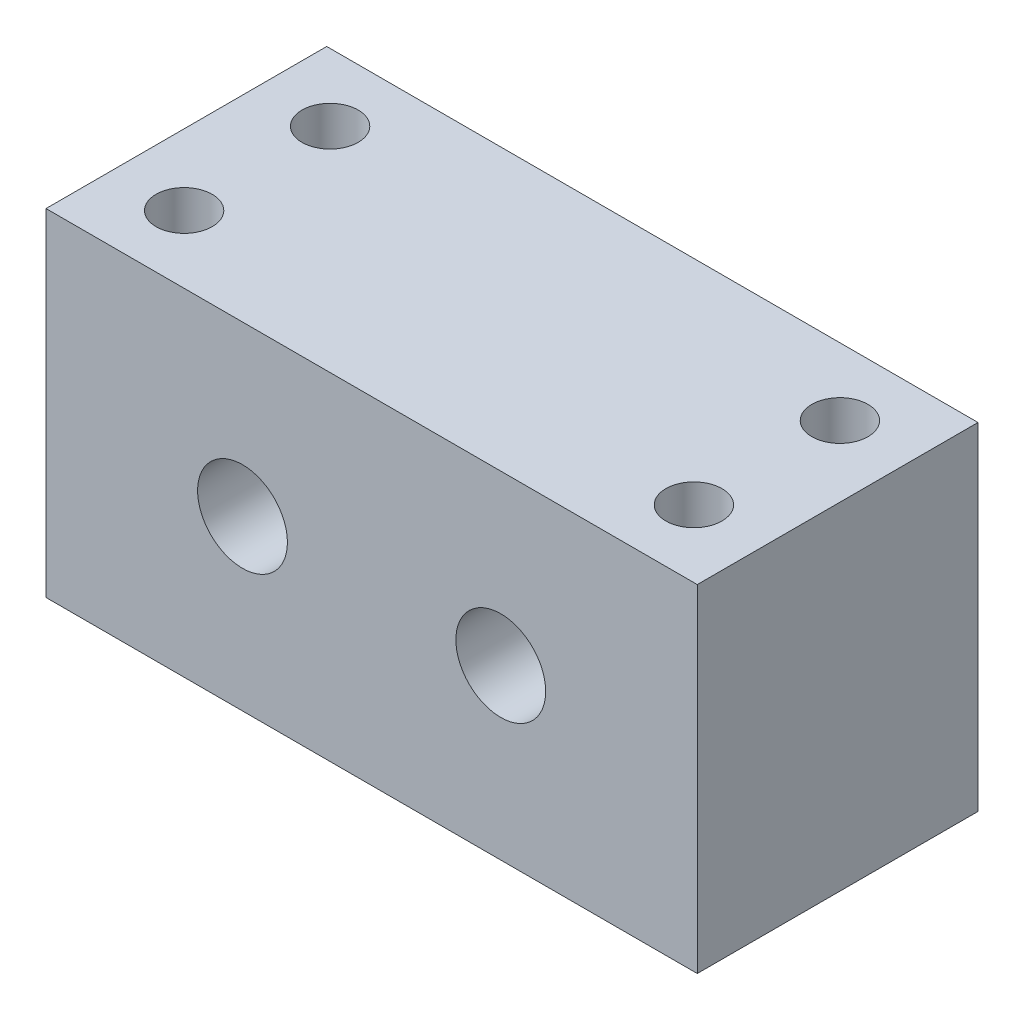
ISO-10303-21;
HEADER;
FILE_DESCRIPTION(('STEP AP214'),'2;1');
FILE_NAME('part.step','',(''),(''),'','','');
FILE_SCHEMA(('AUTOMOTIVE_DESIGN { 1 0 10303 214 1 1 1 1 }'));
ENDSEC;
DATA;
#1=APPLICATION_CONTEXT('core data for automotive mechanical design processes');
#2=APPLICATION_PROTOCOL_DEFINITION('international standard','automotive_design',2000,#1);
#3=PRODUCT_CONTEXT('',#1,'mechanical');
#4=PRODUCT('Part','Part','',(#3));
#5=PRODUCT_RELATED_PRODUCT_CATEGORY('part','',(#4));
#6=PRODUCT_DEFINITION_FORMATION('','',#4);
#7=PRODUCT_DEFINITION_CONTEXT('part definition',#1,'design');
#8=PRODUCT_DEFINITION('design','',#6,#7);
#9=PRODUCT_DEFINITION_SHAPE('','',#8);
#10=(LENGTH_UNIT() NAMED_UNIT(*) SI_UNIT(.MILLI.,.METRE.));
#11=(NAMED_UNIT(*) PLANE_ANGLE_UNIT() SI_UNIT($,.RADIAN.));
#12=(NAMED_UNIT(*) SI_UNIT($,.STERADIAN.) SOLID_ANGLE_UNIT());
#13=UNCERTAINTY_MEASURE_WITH_UNIT(LENGTH_MEASURE(1.E-05),#10,'distance_accuracy_value','');
#14=(GEOMETRIC_REPRESENTATION_CONTEXT(3) GLOBAL_UNCERTAINTY_ASSIGNED_CONTEXT((#13)) GLOBAL_UNIT_ASSIGNED_CONTEXT((#10,
#11,#12)) REPRESENTATION_CONTEXT('',''));
#15=CARTESIAN_POINT('',(0.,0.,0.));
#16=DIRECTION('',(0.,0.,1.));
#17=DIRECTION('',(1.,0.,0.));
#18=AXIS2_PLACEMENT_3D('',#15,#16,#17);
#19=CARTESIAN_POINT('',(0.,0.,25.));
#20=DIRECTION('',(1.,0.,0.));
#21=DIRECTION('',(0.,0.,-1.));
#22=AXIS2_PLACEMENT_3D('',#19,#20,#21);
#23=PLANE('',#22);
#24=DIRECTION('',(0.,-1.,0.));
#25=VECTOR('',#24,1.);
#26=CARTESIAN_POINT('',(0.,0.,0.));
#27=LINE('',#26,#25);
#28=CARTESIAN_POINT('',(0.,30.,0.));
#29=VERTEX_POINT('',#28);
#30=CARTESIAN_POINT('',(0.,0.,0.));
#31=VERTEX_POINT('',#30);
#32=EDGE_CURVE('E128',#29,#31,#27,.T.);
#33=ORIENTED_EDGE('',*,*,#32,.T.);
#34=DIRECTION('',(0.,0.,-1.));
#35=VECTOR('',#34,1.);
#36=CARTESIAN_POINT('',(0.,0.,25.));
#37=LINE('',#36,#35);
#38=CARTESIAN_POINT('',(0.,0.,25.));
#39=VERTEX_POINT('',#38);
#40=EDGE_CURVE('E11',#39,#31,#37,.T.);
#41=ORIENTED_EDGE('',*,*,#40,.F.);
#42=DIRECTION('',(0.,-1.,0.));
#43=VECTOR('',#42,1.);
#44=CARTESIAN_POINT('',(0.,0.,25.));
#45=LINE('',#44,#43);
#46=CARTESIAN_POINT('',(0.,30.,25.));
#47=VERTEX_POINT('',#46);
#48=EDGE_CURVE('E129',#47,#39,#45,.T.);
#49=ORIENTED_EDGE('',*,*,#48,.F.);
#50=DIRECTION('',(0.,0.,-1.));
#51=VECTOR('',#50,1.);
#52=CARTESIAN_POINT('',(0.,30.,25.));
#53=LINE('',#52,#51);
#54=EDGE_CURVE('E135',#47,#29,#53,.T.);
#55=ORIENTED_EDGE('',*,*,#54,.T.);
#56=EDGE_LOOP('',(#33,#41,#49,#55));
#57=FACE_BOUND('',#56,.T.);
#58=ADVANCED_FACE('F33',(#57),#23,.F.);
#59=CARTESIAN_POINT('',(0.,0.,25.));
#60=DIRECTION('',(0.,1.,0.));
#61=DIRECTION('',(0.,0.,1.));
#62=AXIS2_PLACEMENT_3D('',#59,#60,#61);
#63=PLANE('',#62);
#64=DIRECTION('',(1.,0.,0.));
#65=VECTOR('',#64,1.);
#66=CARTESIAN_POINT('',(0.,0.,0.));
#67=LINE('',#66,#65);
#68=CARTESIAN_POINT('',(58.,0.,0.));
#69=VERTEX_POINT('',#68);
#70=EDGE_CURVE('E138',#31,#69,#67,.T.);
#71=ORIENTED_EDGE('',*,*,#70,.T.);
#72=DIRECTION('',(0.,0.,-1.));
#73=VECTOR('',#72,1.);
#74=CARTESIAN_POINT('',(58.,0.,25.));
#75=LINE('',#74,#73);
#76=CARTESIAN_POINT('',(58.,0.,25.));
#77=VERTEX_POINT('',#76);
#78=EDGE_CURVE('E41',#77,#69,#75,.T.);
#79=ORIENTED_EDGE('',*,*,#78,.F.);
#80=DIRECTION('',(1.,0.,0.));
#81=VECTOR('',#80,1.);
#82=CARTESIAN_POINT('',(0.,0.,25.));
#83=LINE('',#82,#81);
#84=EDGE_CURVE('E80',#39,#77,#83,.T.);
#85=ORIENTED_EDGE('',*,*,#84,.F.);
#86=ORIENTED_EDGE('',*,*,#40,.T.);
#87=EDGE_LOOP('',(#71,#79,#85,#86));
#88=FACE_BOUND('',#87,.T.);
#89=ADVANCED_FACE('F163',(#88),#63,.F.);
#90=CARTESIAN_POINT('',(58.,0.,25.));
#91=DIRECTION('',(-1.,0.,0.));
#92=DIRECTION('',(0.,0.,1.));
#93=AXIS2_PLACEMENT_3D('',#90,#91,#92);
#94=PLANE('',#93);
#95=DIRECTION('',(0.,1.,0.));
#96=VECTOR('',#95,1.);
#97=CARTESIAN_POINT('',(58.,0.,0.));
#98=LINE('',#97,#96);
#99=CARTESIAN_POINT('',(58.,30.,0.));
#100=VERTEX_POINT('',#99);
#101=EDGE_CURVE('E67',#69,#100,#98,.T.);
#102=ORIENTED_EDGE('',*,*,#101,.T.);
#103=DIRECTION('',(0.,0.,-1.));
#104=VECTOR('',#103,1.);
#105=CARTESIAN_POINT('',(58.,30.,25.));
#106=LINE('',#105,#104);
#107=CARTESIAN_POINT('',(58.,30.,25.));
#108=VERTEX_POINT('',#107);
#109=EDGE_CURVE('E143',#108,#100,#106,.T.);
#110=ORIENTED_EDGE('',*,*,#109,.F.);
#111=DIRECTION('',(0.,1.,0.));
#112=VECTOR('',#111,1.);
#113=CARTESIAN_POINT('',(58.,0.,25.));
#114=LINE('',#113,#112);
#115=EDGE_CURVE('E132',#77,#108,#114,.T.);
#116=ORIENTED_EDGE('',*,*,#115,.F.);
#117=ORIENTED_EDGE('',*,*,#78,.T.);
#118=EDGE_LOOP('',(#102,#110,#116,#117));
#119=FACE_BOUND('',#118,.T.);
#120=ADVANCED_FACE('F145',(#119),#94,.F.);
#121=CARTESIAN_POINT('',(0.,30.,25.));
#122=DIRECTION('',(0.,-1.,0.));
#123=DIRECTION('',(0.,0.,-1.));
#124=AXIS2_PLACEMENT_3D('',#121,#122,#123);
#125=PLANE('',#124);
#126=CARTESIAN_POINT('',(6.3,30.,6.00000000000001));
#127=DIRECTION('',(0.,1.,0.));
#128=DIRECTION('',(0.,0.,1.));
#129=AXIS2_PLACEMENT_3D('',#126,#127,#128);
#130=CIRCLE('',#129,2.5);
#131=CARTESIAN_POINT('',(6.3,30.,8.50000000000001));
#132=VERTEX_POINT('',#131);
#133=EDGE_CURVE('E104',#132,#132,#130,.T.);
#134=ORIENTED_EDGE('',*,*,#133,.F.);
#135=EDGE_LOOP('',(#134));
#136=FACE_BOUND('',#135,.T.);
#137=CARTESIAN_POINT('',(6.3,30.,19.));
#138=DIRECTION('',(0.,1.,0.));
#139=DIRECTION('',(0.,0.,1.));
#140=AXIS2_PLACEMENT_3D('',#137,#138,#139);
#141=CIRCLE('',#140,2.5);
#142=CARTESIAN_POINT('',(6.3,30.,21.5));
#143=VERTEX_POINT('',#142);
#144=EDGE_CURVE('E103',#143,#143,#141,.T.);
#145=ORIENTED_EDGE('',*,*,#144,.F.);
#146=EDGE_LOOP('',(#145));
#147=FACE_BOUND('',#146,.T.);
#148=CARTESIAN_POINT('',(51.7,30.,19.));
#149=DIRECTION('',(0.,1.,0.));
#150=DIRECTION('',(0.,0.,1.));
#151=AXIS2_PLACEMENT_3D('',#148,#149,#150);
#152=CIRCLE('',#151,2.5);
#153=CARTESIAN_POINT('',(51.7,30.,21.5));
#154=VERTEX_POINT('',#153);
#155=EDGE_CURVE('E116',#154,#154,#152,.T.);
#156=ORIENTED_EDGE('',*,*,#155,.F.);
#157=EDGE_LOOP('',(#156));
#158=FACE_BOUND('',#157,.T.);
#159=CARTESIAN_POINT('',(51.7,30.,6.));
#160=DIRECTION('',(0.,1.,0.));
#161=DIRECTION('',(0.,0.,1.));
#162=AXIS2_PLACEMENT_3D('',#159,#160,#161);
#163=CIRCLE('',#162,2.5);
#164=CARTESIAN_POINT('',(51.7,30.,8.5));
#165=VERTEX_POINT('',#164);
#166=EDGE_CURVE('E122',#165,#165,#163,.T.);
#167=ORIENTED_EDGE('',*,*,#166,.F.);
#168=EDGE_LOOP('',(#167));
#169=FACE_BOUND('',#168,.T.);
#170=DIRECTION('',(-1.,0.,0.));
#171=VECTOR('',#170,1.);
#172=CARTESIAN_POINT('',(0.,30.,0.));
#173=LINE('',#172,#171);
#174=EDGE_CURVE('E73',#100,#29,#173,.T.);
#175=ORIENTED_EDGE('',*,*,#174,.T.);
#176=ORIENTED_EDGE('',*,*,#54,.F.);
#177=DIRECTION('',(-1.,0.,0.));
#178=VECTOR('',#177,1.);
#179=CARTESIAN_POINT('',(0.,30.,25.));
#180=LINE('',#179,#178);
#181=EDGE_CURVE('E49',#108,#47,#180,.T.);
#182=ORIENTED_EDGE('',*,*,#181,.F.);
#183=ORIENTED_EDGE('',*,*,#109,.T.);
#184=EDGE_LOOP('',(#175,#176,#182,#183));
#185=FACE_BOUND('',#184,.T.);
#186=ADVANCED_FACE('F152',(#136,#147,#158,#169,#185),#125,.F.);
#187=CARTESIAN_POINT('',(0.,0.,25.));
#188=DIRECTION('',(0.,0.,-1.));
#189=DIRECTION('',(-1.,0.,0.));
#190=AXIS2_PLACEMENT_3D('',#187,#188,#189);
#191=PLANE('',#190);
#192=CARTESIAN_POINT('',(17.5,15.,25.));
#193=DIRECTION('',(0.,0.,1.));
#194=DIRECTION('',(1.,0.,0.));
#195=AXIS2_PLACEMENT_3D('',#192,#193,#194);
#196=CIRCLE('',#195,4.);
#197=CARTESIAN_POINT('',(21.5,15.,25.));
#198=VERTEX_POINT('',#197);
#199=EDGE_CURVE('E299',#198,#198,#196,.T.);
#200=ORIENTED_EDGE('',*,*,#199,.F.);
#201=EDGE_LOOP('',(#200));
#202=FACE_BOUND('',#201,.T.);
#203=CARTESIAN_POINT('',(40.5,15.,25.));
#204=DIRECTION('',(0.,0.,1.));
#205=DIRECTION('',(1.,0.,0.));
#206=AXIS2_PLACEMENT_3D('',#203,#204,#205);
#207=CIRCLE('',#206,4.);
#208=CARTESIAN_POINT('',(44.5,15.,25.));
#209=VERTEX_POINT('',#208);
#210=EDGE_CURVE('E301',#209,#209,#207,.T.);
#211=ORIENTED_EDGE('',*,*,#210,.F.);
#212=EDGE_LOOP('',(#211));
#213=FACE_BOUND('',#212,.T.);
#214=ORIENTED_EDGE('',*,*,#48,.T.);
#215=ORIENTED_EDGE('',*,*,#84,.T.);
#216=ORIENTED_EDGE('',*,*,#115,.T.);
#217=ORIENTED_EDGE('',*,*,#181,.T.);
#218=EDGE_LOOP('',(#214,#215,#216,#217));
#219=FACE_BOUND('',#218,.T.);
#220=ADVANCED_FACE('F154',(#202,#213,#219),#191,.F.);
#221=CARTESIAN_POINT('',(0.,0.,0.));
#222=DIRECTION('',(0.,0.,-1.));
#223=DIRECTION('',(-1.,0.,0.));
#224=AXIS2_PLACEMENT_3D('',#221,#222,#223);
#225=PLANE('',#224);
#226=CARTESIAN_POINT('',(17.5,15.,0.));
#227=DIRECTION('',(0.,0.,1.));
#228=DIRECTION('',(1.,0.,0.));
#229=AXIS2_PLACEMENT_3D('',#226,#227,#228);
#230=CIRCLE('',#229,3.99999999999999);
#231=CARTESIAN_POINT('',(21.5,15.,0.));
#232=VERTEX_POINT('',#231);
#233=EDGE_CURVE('E296',#232,#232,#230,.T.);
#234=ORIENTED_EDGE('',*,*,#233,.T.);
#235=EDGE_LOOP('',(#234));
#236=FACE_BOUND('',#235,.T.);
#237=CARTESIAN_POINT('',(40.5,15.,0.));
#238=DIRECTION('',(0.,0.,1.));
#239=DIRECTION('',(1.,0.,0.));
#240=AXIS2_PLACEMENT_3D('',#237,#238,#239);
#241=CIRCLE('',#240,4.);
#242=CARTESIAN_POINT('',(44.5,15.,0.));
#243=VERTEX_POINT('',#242);
#244=EDGE_CURVE('E110',#243,#243,#241,.T.);
#245=ORIENTED_EDGE('',*,*,#244,.T.);
#246=EDGE_LOOP('',(#245));
#247=FACE_BOUND('',#246,.T.);
#248=ORIENTED_EDGE('',*,*,#32,.F.);
#249=ORIENTED_EDGE('',*,*,#174,.F.);
#250=ORIENTED_EDGE('',*,*,#101,.F.);
#251=ORIENTED_EDGE('',*,*,#70,.F.);
#252=EDGE_LOOP('',(#248,#249,#250,#251));
#253=FACE_BOUND('',#252,.T.);
#254=ADVANCED_FACE('F148',(#236,#247,#253),#225,.T.);
#255=CARTESIAN_POINT('',(51.7,15.,6.));
#256=DIRECTION('',(0.,1.,0.));
#257=DIRECTION('',(0.,0.,1.));
#258=AXIS2_PLACEMENT_3D('',#255,#256,#257);
#259=CONICAL_SURFACE('',#258,2.5,1.02974425867665);
#260=CARTESIAN_POINT('',(51.7,13.4978484524311,6.));
#261=VERTEX_POINT('',#260);
#262=VERTEX_LOOP('',#261);
#263=FACE_BOUND('',#262,.T.);
#264=CARTESIAN_POINT('',(51.7,15.,6.));
#265=DIRECTION('',(0.,1.,0.));
#266=DIRECTION('',(0.,0.,1.));
#267=AXIS2_PLACEMENT_3D('',#264,#265,#266);
#268=CIRCLE('',#267,2.5);
#269=CARTESIAN_POINT('',(51.7,15.,8.5));
#270=VERTEX_POINT('',#269);
#271=EDGE_CURVE('E125',#270,#270,#268,.T.);
#272=ORIENTED_EDGE('',*,*,#271,.T.);
#273=EDGE_LOOP('',(#272));
#274=FACE_BOUND('',#273,.T.);
#275=ADVANCED_FACE('F188',(#263,#274),#259,.F.);
#276=CARTESIAN_POINT('',(51.7,30.,6.));
#277=DIRECTION('',(0.,1.,0.));
#278=DIRECTION('',(0.,0.,1.));
#279=AXIS2_PLACEMENT_3D('',#276,#277,#278);
#280=CYLINDRICAL_SURFACE('',#279,2.5);
#281=ORIENTED_EDGE('',*,*,#271,.F.);
#282=EDGE_LOOP('',(#281));
#283=FACE_BOUND('',#282,.T.);
#284=ORIENTED_EDGE('',*,*,#166,.T.);
#285=EDGE_LOOP('',(#284));
#286=FACE_BOUND('',#285,.T.);
#287=ADVANCED_FACE('F193',(#283,#286),#280,.F.);
#288=CARTESIAN_POINT('',(51.7,15.,19.));
#289=DIRECTION('',(0.,1.,0.));
#290=DIRECTION('',(0.,0.,1.));
#291=AXIS2_PLACEMENT_3D('',#288,#289,#290);
#292=CONICAL_SURFACE('',#291,2.5,1.02974425867665);
#293=CARTESIAN_POINT('',(51.7,13.4978484524311,19.));
#294=VERTEX_POINT('',#293);
#295=VERTEX_LOOP('',#294);
#296=FACE_BOUND('',#295,.T.);
#297=CARTESIAN_POINT('',(51.7,15.,19.));
#298=DIRECTION('',(0.,1.,0.));
#299=DIRECTION('',(0.,0.,1.));
#300=AXIS2_PLACEMENT_3D('',#297,#298,#299);
#301=CIRCLE('',#300,2.5);
#302=CARTESIAN_POINT('',(51.7,15.,21.5));
#303=VERTEX_POINT('',#302);
#304=EDGE_CURVE('E119',#303,#303,#301,.T.);
#305=ORIENTED_EDGE('',*,*,#304,.T.);
#306=EDGE_LOOP('',(#305));
#307=FACE_BOUND('',#306,.T.);
#308=ADVANCED_FACE('F205',(#296,#307),#292,.F.);
#309=CARTESIAN_POINT('',(51.7,30.,19.));
#310=DIRECTION('',(0.,1.,0.));
#311=DIRECTION('',(0.,0.,1.));
#312=AXIS2_PLACEMENT_3D('',#309,#310,#311);
#313=CYLINDRICAL_SURFACE('',#312,2.5);
#314=ORIENTED_EDGE('',*,*,#304,.F.);
#315=EDGE_LOOP('',(#314));
#316=FACE_BOUND('',#315,.T.);
#317=ORIENTED_EDGE('',*,*,#155,.T.);
#318=EDGE_LOOP('',(#317));
#319=FACE_BOUND('',#318,.T.);
#320=ADVANCED_FACE('F215',(#316,#319),#313,.F.);
#321=CARTESIAN_POINT('',(6.3,15.,19.));
#322=DIRECTION('',(0.,1.,0.));
#323=DIRECTION('',(0.,0.,1.));
#324=AXIS2_PLACEMENT_3D('',#321,#322,#323);
#325=CONICAL_SURFACE('',#324,2.5,1.02974425867665);
#326=CARTESIAN_POINT('',(6.3,13.4978484524311,19.));
#327=VERTEX_POINT('',#326);
#328=VERTEX_LOOP('',#327);
#329=FACE_BOUND('',#328,.T.);
#330=CARTESIAN_POINT('',(6.3,15.,19.));
#331=DIRECTION('',(0.,1.,0.));
#332=DIRECTION('',(0.,0.,1.));
#333=AXIS2_PLACEMENT_3D('',#330,#331,#332);
#334=CIRCLE('',#333,2.5);
#335=CARTESIAN_POINT('',(6.3,15.,21.5));
#336=VERTEX_POINT('',#335);
#337=EDGE_CURVE('E107',#336,#336,#334,.T.);
#338=ORIENTED_EDGE('',*,*,#337,.T.);
#339=EDGE_LOOP('',(#338));
#340=FACE_BOUND('',#339,.T.);
#341=ADVANCED_FACE('F225',(#329,#340),#325,.F.);
#342=CARTESIAN_POINT('',(6.3,30.,19.));
#343=DIRECTION('',(0.,1.,0.));
#344=DIRECTION('',(0.,0.,1.));
#345=AXIS2_PLACEMENT_3D('',#342,#343,#344);
#346=CYLINDRICAL_SURFACE('',#345,2.5);
#347=ORIENTED_EDGE('',*,*,#337,.F.);
#348=EDGE_LOOP('',(#347));
#349=FACE_BOUND('',#348,.T.);
#350=ORIENTED_EDGE('',*,*,#144,.T.);
#351=EDGE_LOOP('',(#350));
#352=FACE_BOUND('',#351,.T.);
#353=ADVANCED_FACE('F97',(#349,#352),#346,.F.);
#354=CARTESIAN_POINT('',(6.3,15.,6.00000000000001));
#355=DIRECTION('',(0.,1.,0.));
#356=DIRECTION('',(0.,0.,1.));
#357=AXIS2_PLACEMENT_3D('',#354,#355,#356);
#358=CONICAL_SURFACE('',#357,2.5,1.02974425867665);
#359=CARTESIAN_POINT('',(6.3,13.4978484524311,6.00000000000001));
#360=VERTEX_POINT('',#359);
#361=VERTEX_LOOP('',#360);
#362=FACE_BOUND('',#361,.T.);
#363=CARTESIAN_POINT('',(6.3,15.,6.00000000000001));
#364=DIRECTION('',(0.,1.,0.));
#365=DIRECTION('',(0.,0.,1.));
#366=AXIS2_PLACEMENT_3D('',#363,#364,#365);
#367=CIRCLE('',#366,2.5);
#368=CARTESIAN_POINT('',(6.3,15.,8.5));
#369=VERTEX_POINT('',#368);
#370=EDGE_CURVE('E101',#369,#369,#367,.T.);
#371=ORIENTED_EDGE('',*,*,#370,.T.);
#372=EDGE_LOOP('',(#371));
#373=FACE_BOUND('',#372,.T.);
#374=ADVANCED_FACE('F93',(#362,#373),#358,.F.);
#375=CARTESIAN_POINT('',(6.3,30.,6.00000000000001));
#376=DIRECTION('',(0.,1.,0.));
#377=DIRECTION('',(0.,0.,1.));
#378=AXIS2_PLACEMENT_3D('',#375,#376,#377);
#379=CYLINDRICAL_SURFACE('',#378,2.5);
#380=ORIENTED_EDGE('',*,*,#370,.F.);
#381=EDGE_LOOP('',(#380));
#382=FACE_BOUND('',#381,.T.);
#383=ORIENTED_EDGE('',*,*,#133,.T.);
#384=EDGE_LOOP('',(#383));
#385=FACE_BOUND('',#384,.T.);
#386=ADVANCED_FACE('F96',(#382,#385),#379,.F.);
#387=CARTESIAN_POINT('',(40.5,15.,25.));
#388=DIRECTION('',(0.,0.,1.));
#389=DIRECTION('',(1.,0.,0.));
#390=AXIS2_PLACEMENT_3D('',#387,#388,#389);
#391=CYLINDRICAL_SURFACE('',#390,4.);
#392=ORIENTED_EDGE('',*,*,#244,.F.);
#393=EDGE_LOOP('',(#392));
#394=FACE_BOUND('',#393,.T.);
#395=ORIENTED_EDGE('',*,*,#210,.T.);
#396=EDGE_LOOP('',(#395));
#397=FACE_BOUND('',#396,.T.);
#398=ADVANCED_FACE('F259',(#394,#397),#391,.F.);
#399=CARTESIAN_POINT('',(17.5,15.,25.));
#400=DIRECTION('',(0.,0.,1.));
#401=DIRECTION('',(1.,0.,0.));
#402=AXIS2_PLACEMENT_3D('',#399,#400,#401);
#403=CYLINDRICAL_SURFACE('',#402,3.99999999999999);
#404=ORIENTED_EDGE('',*,*,#233,.F.);
#405=EDGE_LOOP('',(#404));
#406=FACE_BOUND('',#405,.T.);
#407=ORIENTED_EDGE('',*,*,#199,.T.);
#408=EDGE_LOOP('',(#407));
#409=FACE_BOUND('',#408,.T.);
#410=ADVANCED_FACE('F279',(#406,#409),#403,.F.);
#411=CLOSED_SHELL('',(#58,#89,#120,#186,#220,#254,#275,#287,#308,#320,#341,#353,#374,#386,#398,#410));
#412=MANIFOLD_SOLID_BREP('B2',#411);
#413=ADVANCED_BREP_SHAPE_REPRESENTATION('',(#18,#412),#14);
#414=SHAPE_DEFINITION_REPRESENTATION(#9,#413);
ENDSEC;
END-ISO-10303-21;
